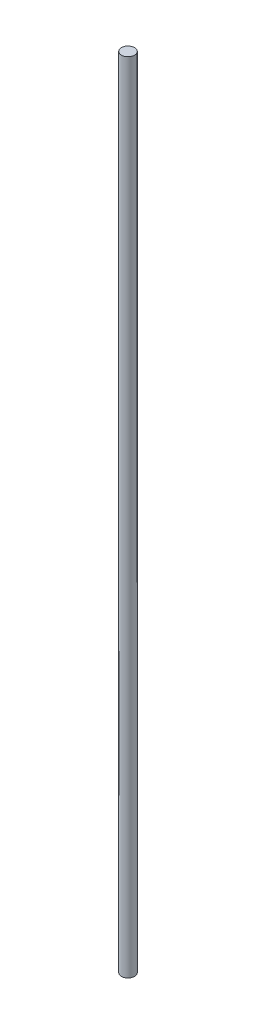
ISO-10303-21;
HEADER;
FILE_DESCRIPTION(('STEP AP214'),'2;1');
FILE_NAME('part.step','',(''),(''),'','','');
FILE_SCHEMA(('AUTOMOTIVE_DESIGN { 1 0 10303 214 1 1 1 1 }'));
ENDSEC;
DATA;
#1=APPLICATION_CONTEXT('core data for automotive mechanical design processes');
#2=APPLICATION_PROTOCOL_DEFINITION('international standard','automotive_design',2000,#1);
#3=PRODUCT_CONTEXT('',#1,'mechanical');
#4=PRODUCT('Part','Part','',(#3));
#5=PRODUCT_RELATED_PRODUCT_CATEGORY('part','',(#4));
#6=PRODUCT_DEFINITION_FORMATION('','',#4);
#7=PRODUCT_DEFINITION_CONTEXT('part definition',#1,'design');
#8=PRODUCT_DEFINITION('design','',#6,#7);
#9=PRODUCT_DEFINITION_SHAPE('','',#8);
#10=(LENGTH_UNIT() NAMED_UNIT(*) SI_UNIT(.MILLI.,.METRE.));
#11=(NAMED_UNIT(*) PLANE_ANGLE_UNIT() SI_UNIT($,.RADIAN.));
#12=(NAMED_UNIT(*) SI_UNIT($,.STERADIAN.) SOLID_ANGLE_UNIT());
#13=UNCERTAINTY_MEASURE_WITH_UNIT(LENGTH_MEASURE(1.E-05),#10,'distance_accuracy_value','');
#14=(GEOMETRIC_REPRESENTATION_CONTEXT(3) GLOBAL_UNCERTAINTY_ASSIGNED_CONTEXT((#13)) GLOBAL_UNIT_ASSIGNED_CONTEXT((#10,
#11,#12)) REPRESENTATION_CONTEXT('',''));
#15=CARTESIAN_POINT('',(0.,0.,0.));
#16=DIRECTION('',(0.,0.,1.));
#17=DIRECTION('',(1.,0.,0.));
#18=AXIS2_PLACEMENT_3D('',#15,#16,#17);
#19=CARTESIAN_POINT('',(0.,608.,0.));
#20=DIRECTION('',(0.,-1.,0.));
#21=DIRECTION('',(0.,0.,-1.));
#22=AXIS2_PLACEMENT_3D('',#19,#20,#21);
#23=CYLINDRICAL_SURFACE('',#22,5.);
#24=CARTESIAN_POINT('',(0.,608.,0.));
#25=DIRECTION('',(0.,1.,0.));
#26=DIRECTION('',(0.,0.,1.));
#27=AXIS2_PLACEMENT_3D('',#24,#25,#26);
#28=CIRCLE('',#27,5.);
#29=CARTESIAN_POINT('',(0.,608.,5.));
#30=VERTEX_POINT('',#29);
#31=EDGE_CURVE('E10',#30,#30,#28,.T.);
#32=ORIENTED_EDGE('',*,*,#31,.F.);
#33=EDGE_LOOP('',(#32));
#34=FACE_BOUND('',#33,.T.);
#35=CARTESIAN_POINT('',(0.,0.,0.));
#36=DIRECTION('',(0.,1.,0.));
#37=DIRECTION('',(0.,0.,1.));
#38=AXIS2_PLACEMENT_3D('',#35,#36,#37);
#39=CIRCLE('',#38,5.);
#40=CARTESIAN_POINT('',(0.,0.,5.));
#41=VERTEX_POINT('',#40);
#42=EDGE_CURVE('E35',#41,#41,#39,.T.);
#43=ORIENTED_EDGE('',*,*,#42,.T.);
#44=EDGE_LOOP('',(#43));
#45=FACE_BOUND('',#44,.T.);
#46=ADVANCED_FACE('F32',(#34,#45),#23,.T.);
#47=CARTESIAN_POINT('',(0.,608.,0.));
#48=DIRECTION('',(0.,1.,0.));
#49=DIRECTION('',(0.,0.,1.));
#50=AXIS2_PLACEMENT_3D('',#47,#48,#49);
#51=PLANE('',#50);
#52=ORIENTED_EDGE('',*,*,#31,.T.);
#53=EDGE_LOOP('',(#52));
#54=FACE_BOUND('',#53,.T.);
#55=ADVANCED_FACE('F47',(#54),#51,.T.);
#56=CARTESIAN_POINT('',(0.,0.,0.));
#57=DIRECTION('',(0.,1.,0.));
#58=DIRECTION('',(0.,0.,1.));
#59=AXIS2_PLACEMENT_3D('',#56,#57,#58);
#60=PLANE('',#59);
#61=ORIENTED_EDGE('',*,*,#42,.F.);
#62=EDGE_LOOP('',(#61));
#63=FACE_BOUND('',#62,.T.);
#64=ADVANCED_FACE('F45',(#63),#60,.F.);
#65=CLOSED_SHELL('',(#46,#55,#64));
#66=MANIFOLD_SOLID_BREP('B2',#65);
#67=ADVANCED_BREP_SHAPE_REPRESENTATION('',(#18,#66),#14);
#68=SHAPE_DEFINITION_REPRESENTATION(#9,#67);
ENDSEC;
END-ISO-10303-21;
